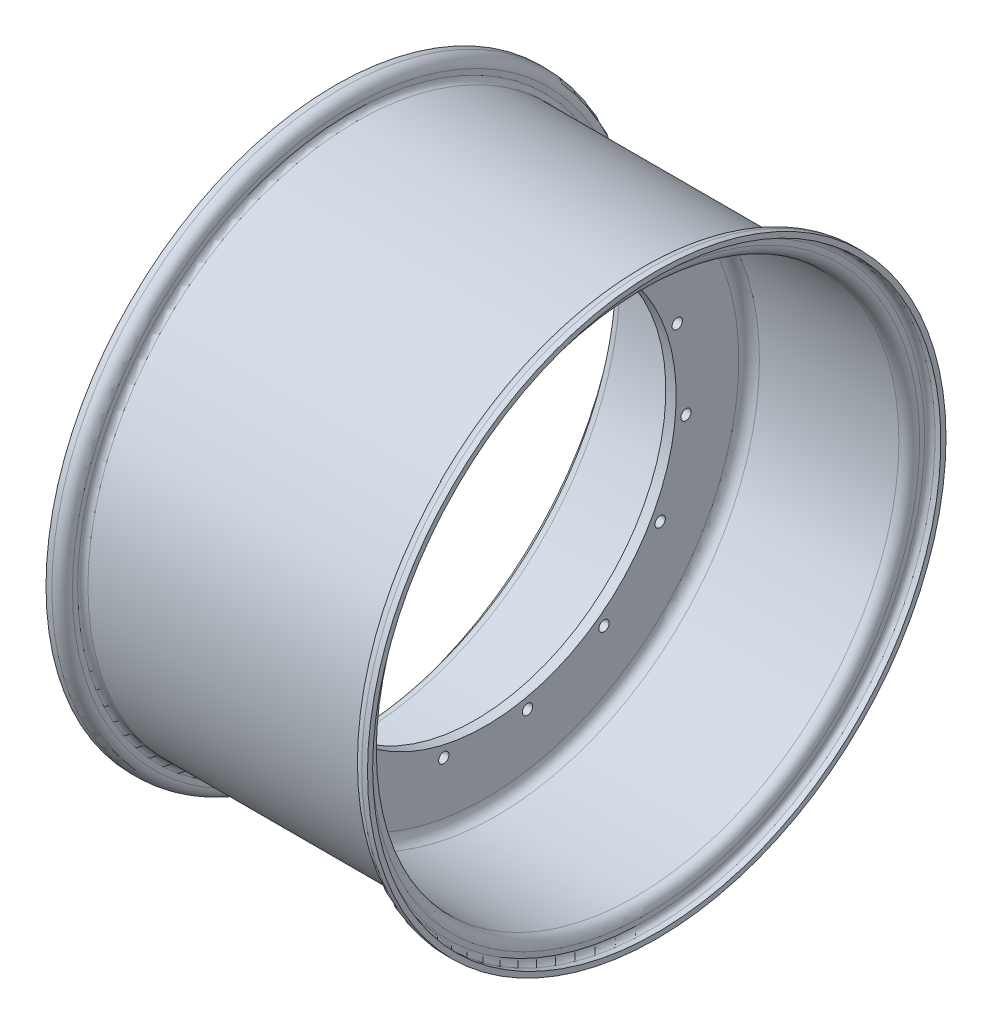
ISO-10303-21;
HEADER;
FILE_DESCRIPTION(('STEP AP214'),'2;1');
FILE_NAME('part.step','',(''),(''),'','','');
FILE_SCHEMA(('AUTOMOTIVE_DESIGN { 1 0 10303 214 1 1 1 1 }'));
ENDSEC;
DATA;
#1=APPLICATION_CONTEXT('core data for automotive mechanical design processes');
#2=APPLICATION_PROTOCOL_DEFINITION('international standard','automotive_design',2000,#1);
#3=PRODUCT_CONTEXT('',#1,'mechanical');
#4=PRODUCT('Part','Part','',(#3));
#5=PRODUCT_RELATED_PRODUCT_CATEGORY('part','',(#4));
#6=PRODUCT_DEFINITION_FORMATION('','',#4);
#7=PRODUCT_DEFINITION_CONTEXT('part definition',#1,'design');
#8=PRODUCT_DEFINITION('design','',#6,#7);
#9=PRODUCT_DEFINITION_SHAPE('','',#8);
#10=(LENGTH_UNIT() NAMED_UNIT(*) SI_UNIT(.MILLI.,.METRE.));
#11=(NAMED_UNIT(*) PLANE_ANGLE_UNIT() SI_UNIT($,.RADIAN.));
#12=(NAMED_UNIT(*) SI_UNIT($,.STERADIAN.) SOLID_ANGLE_UNIT());
#13=UNCERTAINTY_MEASURE_WITH_UNIT(LENGTH_MEASURE(1.E-05),#10,'distance_accuracy_value','');
#14=(GEOMETRIC_REPRESENTATION_CONTEXT(3) GLOBAL_UNCERTAINTY_ASSIGNED_CONTEXT((#13)) GLOBAL_UNIT_ASSIGNED_CONTEXT((#10,
#11,#12)) REPRESENTATION_CONTEXT('',''));
#15=CARTESIAN_POINT('',(0.,0.,0.));
#16=DIRECTION('',(0.,0.,1.));
#17=DIRECTION('',(1.,0.,0.));
#18=AXIS2_PLACEMENT_3D('',#15,#16,#17);
#19=CARTESIAN_POINT('',(104.775,0.,0.));
#20=DIRECTION('',(-1.,0.,0.));
#21=DIRECTION('',(0.,0.,1.));
#22=AXIS2_PLACEMENT_3D('',#19,#20,#21);
#23=TOROIDAL_SURFACE('',#22,171.45,3.17499999999999);
#24=CARTESIAN_POINT('',(104.775,0.,0.));
#25=DIRECTION('',(-1.,0.,0.));
#26=DIRECTION('',(0.,0.,1.));
#27=AXIS2_PLACEMENT_3D('',#24,#25,#26);
#28=CIRCLE('',#27,174.625);
#29=CARTESIAN_POINT('',(104.775,0.,174.625));
#30=VERTEX_POINT('',#29);
#31=EDGE_CURVE('E116',#30,#30,#28,.T.);
#32=ORIENTED_EDGE('',*,*,#31,.F.);
#33=EDGE_LOOP('',(#32));
#34=FACE_BOUND('',#33,.T.);
#35=CARTESIAN_POINT('',(101.6,0.,0.));
#36=DIRECTION('',(-1.,0.,0.));
#37=DIRECTION('',(0.,0.,1.));
#38=AXIS2_PLACEMENT_3D('',#35,#36,#37);
#39=CIRCLE('',#38,171.45);
#40=CARTESIAN_POINT('',(101.6,0.,171.45));
#41=VERTEX_POINT('',#40);
#42=EDGE_CURVE('E53',#41,#41,#39,.T.);
#43=ORIENTED_EDGE('',*,*,#42,.T.);
#44=EDGE_LOOP('',(#43));
#45=FACE_BOUND('',#44,.T.);
#46=ADVANCED_FACE('F33',(#34,#45),#23,.F.);
#47=CARTESIAN_POINT('',(101.6,168.275,0.));
#48=DIRECTION('',(-1.,0.,0.));
#49=DIRECTION('',(0.,0.,1.));
#50=AXIS2_PLACEMENT_3D('',#47,#48,#49);
#51=PLANE('',#50);
#52=ORIENTED_EDGE('',*,*,#42,.F.);
#53=EDGE_LOOP('',(#52));
#54=FACE_BOUND('',#53,.T.);
#55=CARTESIAN_POINT('',(101.6,0.,0.));
#56=DIRECTION('',(-1.,0.,0.));
#57=DIRECTION('',(0.,0.,1.));
#58=AXIS2_PLACEMENT_3D('',#55,#56,#57);
#59=CIRCLE('',#58,168.275);
#60=CARTESIAN_POINT('',(101.6,0.,168.275));
#61=VERTEX_POINT('',#60);
#62=EDGE_CURVE('E56',#61,#61,#59,.T.);
#63=ORIENTED_EDGE('',*,*,#62,.T.);
#64=EDGE_LOOP('',(#63));
#65=FACE_BOUND('',#64,.T.);
#66=ADVANCED_FACE('F261',(#54,#65),#51,.F.);
#67=CARTESIAN_POINT('',(95.25,0.,0.));
#68=DIRECTION('',(-1.,0.,0.));
#69=DIRECTION('',(0.,0.,1.));
#70=AXIS2_PLACEMENT_3D('',#67,#68,#69);
#71=TOROIDAL_SURFACE('',#70,168.275,6.35);
#72=ORIENTED_EDGE('',*,*,#62,.F.);
#73=EDGE_LOOP('',(#72));
#74=FACE_BOUND('',#73,.T.);
#75=CARTESIAN_POINT('',(95.25,0.,0.));
#76=DIRECTION('',(-1.,0.,0.));
#77=DIRECTION('',(0.,0.,1.));
#78=AXIS2_PLACEMENT_3D('',#75,#76,#77);
#79=CIRCLE('',#78,161.925);
#80=CARTESIAN_POINT('',(95.25,0.,161.925));
#81=VERTEX_POINT('',#80);
#82=EDGE_CURVE('E59',#81,#81,#79,.T.);
#83=ORIENTED_EDGE('',*,*,#82,.T.);
#84=EDGE_LOOP('',(#83));
#85=FACE_BOUND('',#84,.T.);
#86=ADVANCED_FACE('F267',(#74,#85),#71,.T.);
#87=CARTESIAN_POINT('',(-87.0379104783021,0.,0.));
#88=DIRECTION('',(-1.,0.,0.));
#89=DIRECTION('',(0.,0.,1.));
#90=AXIS2_PLACEMENT_3D('',#87,#88,#89);
#91=CYLINDRICAL_SURFACE('',#90,161.925);
#92=CARTESIAN_POINT('',(9.52500000000001,0.,0.));
#93=DIRECTION('',(-1.,0.,0.));
#94=DIRECTION('',(0.,0.,1.));
#95=AXIS2_PLACEMENT_3D('',#92,#93,#94);
#96=CIRCLE('',#95,161.925);
#97=CARTESIAN_POINT('',(9.52500000000001,0.,161.925));
#98=VERTEX_POINT('',#97);
#99=EDGE_CURVE('E40',#98,#98,#96,.T.);
#100=ORIENTED_EDGE('',*,*,#99,.T.);
#101=EDGE_LOOP('',(#100));
#102=FACE_BOUND('',#101,.T.);
#103=ORIENTED_EDGE('',*,*,#82,.F.);
#104=EDGE_LOOP('',(#103));
#105=FACE_BOUND('',#104,.T.);
#106=ADVANCED_FACE('F257',(#102,#105),#91,.F.);
#107=CARTESIAN_POINT('',(3.17500000000001,117.094,0.));
#108=DIRECTION('',(-1.,0.,0.));
#109=DIRECTION('',(0.,0.,1.));
#110=AXIS2_PLACEMENT_3D('',#107,#108,#109);
#111=PLANE('',#110);
#112=CARTESIAN_POINT('',(3.17500000000001,0.,0.));
#113=DIRECTION('',(-1.,0.,0.));
#114=DIRECTION('',(0.,0.,1.));
#115=AXIS2_PLACEMENT_3D('',#112,#113,#114);
#116=CIRCLE('',#115,155.575);
#117=CARTESIAN_POINT('',(3.17500000000001,0.,155.575));
#118=VERTEX_POINT('',#117);
#119=EDGE_CURVE('E10',#118,#118,#116,.F.);
#120=ORIENTED_EDGE('',*,*,#119,.T.);
#121=EDGE_LOOP('',(#120));
#122=FACE_BOUND('',#121,.T.);
#123=CARTESIAN_POINT('',(3.17500000000001,113.119766292596,50.3641648288596));
#124=DIRECTION('',(-1.,0.,0.));
#125=DIRECTION('',(0.,0.,1.));
#126=AXIS2_PLACEMENT_3D('',#123,#124,#125);
#127=CIRCLE('',#126,3.175);
#128=CARTESIAN_POINT('',(3.17500000000001,113.119766292596,53.5391648288595));
#129=VERTEX_POINT('',#128);
#130=EDGE_CURVE('E203',#129,#129,#127,.T.);
#131=ORIENTED_EDGE('',*,*,#130,.T.);
#132=EDGE_LOOP('',(#131));
#133=FACE_BOUND('',#132,.T.);
#134=CARTESIAN_POINT('',(3.17500000000001,82.8550973323867,92.0199080147374));
#135=DIRECTION('',(-1.,0.,0.));
#136=DIRECTION('',(0.,0.,1.));
#137=AXIS2_PLACEMENT_3D('',#134,#135,#136);
#138=CIRCLE('',#137,3.175);
#139=CARTESIAN_POINT('',(3.17500000000001,82.8550973323867,95.1949080147374));
#140=VERTEX_POINT('',#139);
#141=EDGE_CURVE('E197',#140,#140,#138,.T.);
#142=ORIENTED_EDGE('',*,*,#141,.T.);
#143=EDGE_LOOP('',(#142));
#144=FACE_BOUND('',#143,.T.);
#145=CARTESIAN_POINT('',(3.17500000000001,38.2640293284791,117.764573130247));
#146=DIRECTION('',(-1.,0.,0.));
#147=DIRECTION('',(0.,0.,1.));
#148=AXIS2_PLACEMENT_3D('',#145,#146,#147);
#149=CIRCLE('',#148,3.175);
#150=CARTESIAN_POINT('',(3.17500000000001,38.2640293284791,120.939573130247));
#151=VERTEX_POINT('',#150);
#152=EDGE_CURVE('E191',#151,#151,#149,.T.);
#153=ORIENTED_EDGE('',*,*,#152,.T.);
#154=EDGE_LOOP('',(#153));
#155=FACE_BOUND('',#154,.T.);
#156=CARTESIAN_POINT('',(3.17500000000001,-12.943236964116,123.146673693977));
#157=DIRECTION('',(-1.,0.,0.));
#158=DIRECTION('',(0.,0.,1.));
#159=AXIS2_PLACEMENT_3D('',#156,#157,#158);
#160=CIRCLE('',#159,3.175);
#161=CARTESIAN_POINT('',(3.17500000000001,-12.943236964116,126.321673693977));
#162=VERTEX_POINT('',#161);
#163=EDGE_CURVE('E185',#162,#162,#160,.T.);
#164=ORIENTED_EDGE('',*,*,#163,.T.);
#165=EDGE_LOOP('',(#164));
#166=FACE_BOUND('',#165,.T.);
#167=CARTESIAN_POINT('',(3.17500000000001,-61.912499999999,107.235595623609));
#168=DIRECTION('',(-1.,0.,0.));
#169=DIRECTION('',(0.,0.,1.));
#170=AXIS2_PLACEMENT_3D('',#167,#168,#169);
#171=CIRCLE('',#170,3.175);
#172=CARTESIAN_POINT('',(3.17500000000001,-61.912499999999,110.410595623609));
#173=VERTEX_POINT('',#172);
#174=EDGE_CURVE('E179',#173,#173,#171,.T.);
#175=ORIENTED_EDGE('',*,*,#174,.T.);
#176=EDGE_LOOP('',(#175));
#177=FACE_BOUND('',#176,.T.);
#178=CARTESIAN_POINT('',(3.17500000000001,-100.176529328477,72.7825088651163));
#179=DIRECTION('',(-1.,0.,0.));
#180=DIRECTION('',(0.,0.,1.));
#181=AXIS2_PLACEMENT_3D('',#178,#179,#180);
#182=CIRCLE('',#181,3.175);
#183=CARTESIAN_POINT('',(3.17500000000001,-100.176529328477,75.9575088651163));
#184=VERTEX_POINT('',#183);
#185=EDGE_CURVE('E173',#184,#184,#182,.T.);
#186=ORIENTED_EDGE('',*,*,#185,.T.);
#187=EDGE_LOOP('',(#186));
#188=FACE_BOUND('',#187,.T.);
#189=CARTESIAN_POINT('',(3.17500000000001,-121.119126660863,25.7446651155099));
#190=DIRECTION('',(-1.,0.,0.));
#191=DIRECTION('',(0.,0.,1.));
#192=AXIS2_PLACEMENT_3D('',#189,#190,#191);
#193=CIRCLE('',#192,3.175);
#194=CARTESIAN_POINT('',(3.17500000000001,-121.119126660863,28.9196651155099));
#195=VERTEX_POINT('',#194);
#196=EDGE_CURVE('E167',#195,#195,#193,.T.);
#197=ORIENTED_EDGE('',*,*,#196,.T.);
#198=EDGE_LOOP('',(#197));
#199=FACE_BOUND('',#198,.T.);
#200=CARTESIAN_POINT('',(3.17500000000001,-121.119126660864,-25.7446651155083));
#201=DIRECTION('',(-1.,0.,0.));
#202=DIRECTION('',(0.,0.,1.));
#203=AXIS2_PLACEMENT_3D('',#200,#201,#202);
#204=CIRCLE('',#203,3.175);
#205=CARTESIAN_POINT('',(3.17500000000001,-121.119126660864,-22.5696651155083));
#206=VERTEX_POINT('',#205);
#207=EDGE_CURVE('E161',#206,#206,#204,.T.);
#208=ORIENTED_EDGE('',*,*,#207,.T.);
#209=EDGE_LOOP('',(#208));
#210=FACE_BOUND('',#209,.T.);
#211=CARTESIAN_POINT('',(3.17500000000001,-100.176529328478,-72.782508865115));
#212=DIRECTION('',(-1.,0.,0.));
#213=DIRECTION('',(0.,0.,1.));
#214=AXIS2_PLACEMENT_3D('',#211,#212,#213);
#215=CIRCLE('',#214,3.175);
#216=CARTESIAN_POINT('',(3.17500000000001,-100.176529328478,-69.607508865115));
#217=VERTEX_POINT('',#216);
#218=EDGE_CURVE('E155',#217,#217,#215,.T.);
#219=ORIENTED_EDGE('',*,*,#218,.T.);
#220=EDGE_LOOP('',(#219));
#221=FACE_BOUND('',#220,.T.);
#222=CARTESIAN_POINT('',(3.17500000000001,-61.9125000000005,-107.235595623608));
#223=DIRECTION('',(-1.,0.,0.));
#224=DIRECTION('',(0.,0.,1.));
#225=AXIS2_PLACEMENT_3D('',#222,#223,#224);
#226=CIRCLE('',#225,3.175);
#227=CARTESIAN_POINT('',(3.17500000000001,-61.9125000000005,-104.060595623608));
#228=VERTEX_POINT('',#227);
#229=EDGE_CURVE('E149',#228,#228,#226,.T.);
#230=ORIENTED_EDGE('',*,*,#229,.T.);
#231=EDGE_LOOP('',(#230));
#232=FACE_BOUND('',#231,.T.);
#233=CARTESIAN_POINT('',(3.17500000000001,-12.9432369641176,-123.146673693976));
#234=DIRECTION('',(-1.,0.,0.));
#235=DIRECTION('',(0.,0.,1.));
#236=AXIS2_PLACEMENT_3D('',#233,#234,#235);
#237=CIRCLE('',#236,3.175);
#238=CARTESIAN_POINT('',(3.17500000000001,-12.9432369641176,-119.971673693976));
#239=VERTEX_POINT('',#238);
#240=EDGE_CURVE('E143',#239,#239,#237,.T.);
#241=ORIENTED_EDGE('',*,*,#240,.T.);
#242=EDGE_LOOP('',(#241));
#243=FACE_BOUND('',#242,.T.);
#244=CARTESIAN_POINT('',(3.17500000000001,38.2640293284776,-117.764573130247));
#245=DIRECTION('',(-1.,0.,0.));
#246=DIRECTION('',(0.,0.,1.));
#247=AXIS2_PLACEMENT_3D('',#244,#245,#246);
#248=CIRCLE('',#247,3.175);
#249=CARTESIAN_POINT('',(3.17500000000001,38.2640293284776,-114.589573130247));
#250=VERTEX_POINT('',#249);
#251=EDGE_CURVE('E137',#250,#250,#248,.T.);
#252=ORIENTED_EDGE('',*,*,#251,.T.);
#253=EDGE_LOOP('',(#252));
#254=FACE_BOUND('',#253,.T.);
#255=CARTESIAN_POINT('',(3.17500000000001,82.8550973323855,-92.0199080147385));
#256=DIRECTION('',(-1.,0.,0.));
#257=DIRECTION('',(0.,0.,1.));
#258=AXIS2_PLACEMENT_3D('',#255,#256,#257);
#259=CIRCLE('',#258,3.175);
#260=CARTESIAN_POINT('',(3.17500000000001,82.8550973323855,-88.8449080147385));
#261=VERTEX_POINT('',#260);
#262=EDGE_CURVE('E131',#261,#261,#259,.T.);
#263=ORIENTED_EDGE('',*,*,#262,.T.);
#264=EDGE_LOOP('',(#263));
#265=FACE_BOUND('',#264,.T.);
#266=CARTESIAN_POINT('',(3.17500000000001,113.119766292595,-50.3641648288611));
#267=DIRECTION('',(-1.,0.,0.));
#268=DIRECTION('',(0.,0.,1.));
#269=AXIS2_PLACEMENT_3D('',#266,#267,#268);
#270=CIRCLE('',#269,3.175);
#271=CARTESIAN_POINT('',(3.17500000000001,113.119766292595,-47.1891648288611));
#272=VERTEX_POINT('',#271);
#273=EDGE_CURVE('E125',#272,#272,#270,.T.);
#274=ORIENTED_EDGE('',*,*,#273,.T.);
#275=EDGE_LOOP('',(#274));
#276=FACE_BOUND('',#275,.T.);
#277=CARTESIAN_POINT('',(3.17500000000001,123.825,0.));
#278=DIRECTION('',(-1.,0.,0.));
#279=DIRECTION('',(0.,0.,1.));
#280=AXIS2_PLACEMENT_3D('',#277,#278,#279);
#281=CIRCLE('',#280,3.175);
#282=CARTESIAN_POINT('',(3.17500000000001,123.825,3.175));
#283=VERTEX_POINT('',#282);
#284=EDGE_CURVE('E119',#283,#283,#281,.T.);
#285=ORIENTED_EDGE('',*,*,#284,.T.);
#286=EDGE_LOOP('',(#285));
#287=FACE_BOUND('',#286,.T.);
#288=CARTESIAN_POINT('',(3.17500000000001,0.,0.));
#289=DIRECTION('',(-1.,0.,0.));
#290=DIRECTION('',(0.,0.,1.));
#291=AXIS2_PLACEMENT_3D('',#288,#289,#290);
#292=CIRCLE('',#291,117.094);
#293=CARTESIAN_POINT('',(3.17500000000001,0.,117.094));
#294=VERTEX_POINT('',#293);
#295=EDGE_CURVE('E62',#294,#294,#292,.T.);
#296=ORIENTED_EDGE('',*,*,#295,.T.);
#297=EDGE_LOOP('',(#296));
#298=FACE_BOUND('',#297,.T.);
#299=ADVANCED_FACE('F251',(#122,#133,#144,#155,#166,#177,#188,#199,#210,#221,#232,#243,#254,
#265,#276,#287,#298),#111,.F.);
#300=CARTESIAN_POINT('',(-87.0379104783021,0.,0.));
#301=DIRECTION('',(-1.,0.,0.));
#302=DIRECTION('',(0.,0.,1.));
#303=AXIS2_PLACEMENT_3D('',#300,#301,#302);
#304=CYLINDRICAL_SURFACE('',#303,117.094);
#305=ORIENTED_EDGE('',*,*,#295,.F.);
#306=EDGE_LOOP('',(#305));
#307=FACE_BOUND('',#306,.T.);
#308=CARTESIAN_POINT('',(-3.175,0.,0.));
#309=DIRECTION('',(-1.,0.,0.));
#310=DIRECTION('',(0.,0.,1.));
#311=AXIS2_PLACEMENT_3D('',#308,#309,#310);
#312=CIRCLE('',#311,117.094);
#313=CARTESIAN_POINT('',(-3.175,0.,117.094));
#314=VERTEX_POINT('',#313);
#315=EDGE_CURVE('E65',#314,#314,#312,.T.);
#316=ORIENTED_EDGE('',*,*,#315,.T.);
#317=EDGE_LOOP('',(#316));
#318=FACE_BOUND('',#317,.T.);
#319=ADVANCED_FACE('F217',(#307,#318),#304,.F.);
#320=CARTESIAN_POINT('',(-3.175,161.925,0.));
#321=DIRECTION('',(1.,0.,0.));
#322=DIRECTION('',(0.,0.,-1.));
#323=AXIS2_PLACEMENT_3D('',#320,#321,#322);
#324=PLANE('',#323);
#325=CARTESIAN_POINT('',(-3.175,0.,0.));
#326=DIRECTION('',(1.,0.,0.));
#327=DIRECTION('',(0.,0.,-1.));
#328=AXIS2_PLACEMENT_3D('',#325,#326,#327);
#329=CIRCLE('',#328,155.575);
#330=CARTESIAN_POINT('',(-3.175,0.,-155.575));
#331=VERTEX_POINT('',#330);
#332=EDGE_CURVE('E48',#331,#331,#329,.F.);
#333=ORIENTED_EDGE('',*,*,#332,.T.);
#334=EDGE_LOOP('',(#333));
#335=FACE_BOUND('',#334,.T.);
#336=CARTESIAN_POINT('',(-3.175,113.119766292596,50.3641648288596));
#337=DIRECTION('',(-1.,0.,0.));
#338=DIRECTION('',(0.,-0.406736643075789,0.913545457642606));
#339=AXIS2_PLACEMENT_3D('',#336,#337,#338);
#340=CIRCLE('',#339,3.175);
#341=CARTESIAN_POINT('',(-3.175,111.82837745083,53.2646716568748));
#342=VERTEX_POINT('',#341);
#343=EDGE_CURVE('E206',#342,#342,#340,.T.);
#344=ORIENTED_EDGE('',*,*,#343,.F.);
#345=EDGE_LOOP('',(#344));
#346=FACE_BOUND('',#345,.T.);
#347=CARTESIAN_POINT('',(-3.175,82.8550973323867,92.0199080147374));
#348=DIRECTION('',(-1.,0.,0.));
#349=DIRECTION('',(0.,-0.743144825477386,0.669130606358867));
#350=AXIS2_PLACEMENT_3D('',#347,#348,#349);
#351=CIRCLE('',#350,3.175);
#352=CARTESIAN_POINT('',(-3.175,80.495612511496,94.1443976899267));
#353=VERTEX_POINT('',#352);
#354=EDGE_CURVE('E200',#353,#353,#351,.T.);
#355=ORIENTED_EDGE('',*,*,#354,.F.);
#356=EDGE_LOOP('',(#355));
#357=FACE_BOUND('',#356,.T.);
#358=CARTESIAN_POINT('',(-3.175,38.2640293284791,117.764573130247));
#359=DIRECTION('',(-1.,0.,0.));
#360=DIRECTION('',(0.,-0.95105651629515,0.309016994374957));
#361=AXIS2_PLACEMENT_3D('',#358,#359,#360);
#362=CIRCLE('',#361,3.175);
#363=CARTESIAN_POINT('',(-3.175,35.244424889242,118.745702087387));
#364=VERTEX_POINT('',#363);
#365=EDGE_CURVE('E194',#364,#364,#362,.T.);
#366=ORIENTED_EDGE('',*,*,#365,.F.);
#367=EDGE_LOOP('',(#366));
#368=FACE_BOUND('',#367,.T.);
#369=CARTESIAN_POINT('',(-3.175,-12.943236964116,123.146673693977));
#370=DIRECTION('',(-1.,0.,0.));
#371=DIRECTION('',(0.,-0.994521895368274,-0.104528463267644));
#372=AXIS2_PLACEMENT_3D('',#369,#370,#371);
#373=CIRCLE('',#372,3.175);
#374=CARTESIAN_POINT('',(-3.175,-16.1008439819102,122.814795823102));
#375=VERTEX_POINT('',#374);
#376=EDGE_CURVE('E188',#375,#375,#373,.T.);
#377=ORIENTED_EDGE('',*,*,#376,.F.);
#378=EDGE_LOOP('',(#377));
#379=FACE_BOUND('',#378,.T.);
#380=CARTESIAN_POINT('',(-3.175,-61.912499999999,107.235595623609));
#381=DIRECTION('',(-1.,0.,0.));
#382=DIRECTION('',(0.,-0.866025403784443,-0.499999999999992));
#383=AXIS2_PLACEMENT_3D('',#380,#381,#382);
#384=CIRCLE('',#383,3.175);
#385=CARTESIAN_POINT('',(-3.175,-64.6621306570146,105.648095623609));
#386=VERTEX_POINT('',#385);
#387=EDGE_CURVE('E182',#386,#386,#384,.T.);
#388=ORIENTED_EDGE('',*,*,#387,.F.);
#389=EDGE_LOOP('',(#388));
#390=FACE_BOUND('',#389,.T.);
#391=CARTESIAN_POINT('',(-3.175,-100.176529328477,72.7825088651163));
#392=DIRECTION('',(-1.,0.,0.));
#393=DIRECTION('',(0.,-0.58778525229248,-0.809016994374943));
#394=AXIS2_PLACEMENT_3D('',#391,#392,#393);
#395=CIRCLE('',#394,3.175);
#396=CARTESIAN_POINT('',(-3.175,-102.042747504506,70.2138799079759));
#397=VERTEX_POINT('',#396);
#398=EDGE_CURVE('E176',#397,#397,#395,.T.);
#399=ORIENTED_EDGE('',*,*,#398,.F.);
#400=EDGE_LOOP('',(#399));
#401=FACE_BOUND('',#400,.T.);
#402=CARTESIAN_POINT('',(-3.175,-121.119126660863,25.7446651155099));
#403=DIRECTION('',(-1.,0.,0.));
#404=DIRECTION('',(0.,-0.207911690817766,-0.978147600733804));
#405=AXIS2_PLACEMENT_3D('',#402,#403,#404);
#406=CIRCLE('',#405,3.175);
#407=CARTESIAN_POINT('',(-3.175,-121.77924627921,22.6390464831801));
#408=VERTEX_POINT('',#407);
#409=EDGE_CURVE('E170',#408,#408,#406,.T.);
#410=ORIENTED_EDGE('',*,*,#409,.F.);
#411=EDGE_LOOP('',(#410));
#412=FACE_BOUND('',#411,.T.);
#413=CARTESIAN_POINT('',(-3.175,-121.119126660864,-25.7446651155083));
#414=DIRECTION('',(-1.,0.,0.));
#415=DIRECTION('',(0.,0.207911690817753,-0.978147600733807));
#416=AXIS2_PLACEMENT_3D('',#413,#414,#415);
#417=CIRCLE('',#416,3.175);
#418=CARTESIAN_POINT('',(-3.175,-120.459007042517,-28.8502837478381));
#419=VERTEX_POINT('',#418);
#420=EDGE_CURVE('E164',#419,#419,#417,.T.);
#421=ORIENTED_EDGE('',*,*,#420,.F.);
#422=EDGE_LOOP('',(#421));
#423=FACE_BOUND('',#422,.T.);
#424=CARTESIAN_POINT('',(-3.175,-100.176529328478,-72.782508865115));
#425=DIRECTION('',(-1.,0.,0.));
#426=DIRECTION('',(0.,0.587785252292469,-0.80901699437495));
#427=AXIS2_PLACEMENT_3D('',#424,#425,#426);
#428=CIRCLE('',#427,3.175);
#429=CARTESIAN_POINT('',(-3.175,-98.3103111524496,-75.3511378222554));
#430=VERTEX_POINT('',#429);
#431=EDGE_CURVE('E158',#430,#430,#428,.T.);
#432=ORIENTED_EDGE('',*,*,#431,.F.);
#433=EDGE_LOOP('',(#432));
#434=FACE_BOUND('',#433,.T.);
#435=CARTESIAN_POINT('',(-3.175,-61.9125000000005,-107.235595623608));
#436=DIRECTION('',(-1.,0.,0.));
#437=DIRECTION('',(0.,0.866025403784436,-0.500000000000004));
#438=AXIS2_PLACEMENT_3D('',#435,#436,#437);
#439=CIRCLE('',#438,3.175);
#440=CARTESIAN_POINT('',(-3.175,-59.1628693429849,-108.823095623608));
#441=VERTEX_POINT('',#440);
#442=EDGE_CURVE('E152',#441,#441,#439,.T.);
#443=ORIENTED_EDGE('',*,*,#442,.F.);
#444=EDGE_LOOP('',(#443));
#445=FACE_BOUND('',#444,.T.);
#446=CARTESIAN_POINT('',(-3.175,-12.9432369641176,-123.146673693976));
#447=DIRECTION('',(-1.,0.,0.));
#448=DIRECTION('',(0.,0.994521895368273,-0.104528463267657));
#449=AXIS2_PLACEMENT_3D('',#446,#447,#448);
#450=CIRCLE('',#449,3.175);
#451=CARTESIAN_POINT('',(-3.175,-9.78562994632337,-123.478551564851));
#452=VERTEX_POINT('',#451);
#453=EDGE_CURVE('E146',#452,#452,#450,.T.);
#454=ORIENTED_EDGE('',*,*,#453,.F.);
#455=EDGE_LOOP('',(#454));
#456=FACE_BOUND('',#455,.T.);
#457=CARTESIAN_POINT('',(-3.175,38.2640293284776,-117.764573130247));
#458=DIRECTION('',(-1.,0.,0.));
#459=DIRECTION('',(0.,0.951056516295154,0.309016994374945));
#460=AXIS2_PLACEMENT_3D('',#457,#458,#459);
#461=CIRCLE('',#460,3.175);
#462=CARTESIAN_POINT('',(-3.175,41.2836337677147,-116.783444173107));
#463=VERTEX_POINT('',#462);
#464=EDGE_CURVE('E140',#463,#463,#461,.T.);
#465=ORIENTED_EDGE('',*,*,#464,.F.);
#466=EDGE_LOOP('',(#465));
#467=FACE_BOUND('',#466,.T.);
#468=CARTESIAN_POINT('',(-3.175,82.8550973323855,-92.0199080147385));
#469=DIRECTION('',(-1.,0.,0.));
#470=DIRECTION('',(0.,0.743144825477395,0.669130606358857));
#471=AXIS2_PLACEMENT_3D('',#468,#469,#470);
#472=CIRCLE('',#471,3.175);
#473=CARTESIAN_POINT('',(-3.175,85.2145821532762,-89.8954183395491));
#474=VERTEX_POINT('',#473);
#475=EDGE_CURVE('E134',#474,#474,#472,.T.);
#476=ORIENTED_EDGE('',*,*,#475,.F.);
#477=EDGE_LOOP('',(#476));
#478=FACE_BOUND('',#477,.T.);
#479=CARTESIAN_POINT('',(-3.175,113.119766292595,-50.3641648288611));
#480=DIRECTION('',(-1.,0.,0.));
#481=DIRECTION('',(0.,0.406736643075801,0.913545457642601));
#482=AXIS2_PLACEMENT_3D('',#479,#480,#481);
#483=CIRCLE('',#482,3.175);
#484=CARTESIAN_POINT('',(-3.175,114.411155134361,-47.4636580008458));
#485=VERTEX_POINT('',#484);
#486=EDGE_CURVE('E128',#485,#485,#483,.T.);
#487=ORIENTED_EDGE('',*,*,#486,.F.);
#488=EDGE_LOOP('',(#487));
#489=FACE_BOUND('',#488,.T.);
#490=CARTESIAN_POINT('',(-3.175,123.825,0.));
#491=DIRECTION('',(-1.,0.,0.));
#492=DIRECTION('',(0.,0.,1.));
#493=AXIS2_PLACEMENT_3D('',#490,#491,#492);
#494=CIRCLE('',#493,3.175);
#495=CARTESIAN_POINT('',(-3.175,123.825,3.175));
#496=VERTEX_POINT('',#495);
#497=EDGE_CURVE('E122',#496,#496,#494,.T.);
#498=ORIENTED_EDGE('',*,*,#497,.F.);
#499=EDGE_LOOP('',(#498));
#500=FACE_BOUND('',#499,.T.);
#501=ORIENTED_EDGE('',*,*,#315,.F.);
#502=EDGE_LOOP('',(#501));
#503=FACE_BOUND('',#502,.T.);
#504=ADVANCED_FACE('F213',(#335,#346,#357,#368,#379,#390,#401,#412,#423,#434,#445,#456,#467,
#478,#489,#500,#503),#324,.F.);
#505=CARTESIAN_POINT('',(-87.0379104783021,0.,0.));
#506=DIRECTION('',(-1.,0.,0.));
#507=DIRECTION('',(0.,0.,1.));
#508=AXIS2_PLACEMENT_3D('',#505,#506,#507);
#509=CYLINDRICAL_SURFACE('',#508,161.925);
#510=CARTESIAN_POINT('',(-9.52500000000001,0.,0.));
#511=DIRECTION('',(1.,0.,0.));
#512=DIRECTION('',(0.,0.,-1.));
#513=AXIS2_PLACEMENT_3D('',#510,#511,#512);
#514=CIRCLE('',#513,161.925);
#515=CARTESIAN_POINT('',(-9.52500000000001,0.,-161.925));
#516=VERTEX_POINT('',#515);
#517=EDGE_CURVE('E44',#516,#516,#514,.T.);
#518=ORIENTED_EDGE('',*,*,#517,.T.);
#519=EDGE_LOOP('',(#518));
#520=FACE_BOUND('',#519,.T.);
#521=CARTESIAN_POINT('',(-76.2,0.,0.));
#522=DIRECTION('',(-1.,0.,0.));
#523=DIRECTION('',(0.,0.,1.));
#524=AXIS2_PLACEMENT_3D('',#521,#522,#523);
#525=CIRCLE('',#524,161.925);
#526=CARTESIAN_POINT('',(-76.2,0.,161.925));
#527=VERTEX_POINT('',#526);
#528=EDGE_CURVE('E68',#527,#527,#525,.T.);
#529=ORIENTED_EDGE('',*,*,#528,.T.);
#530=EDGE_LOOP('',(#529));
#531=FACE_BOUND('',#530,.T.);
#532=ADVANCED_FACE('F216',(#520,#531),#509,.F.);
#533=CARTESIAN_POINT('',(-76.2,0.,0.));
#534=DIRECTION('',(-1.,0.,0.));
#535=DIRECTION('',(0.,0.,1.));
#536=AXIS2_PLACEMENT_3D('',#533,#534,#535);
#537=TOROIDAL_SURFACE('',#536,168.275,6.35000000000002);
#538=ORIENTED_EDGE('',*,*,#528,.F.);
#539=EDGE_LOOP('',(#538));
#540=FACE_BOUND('',#539,.T.);
#541=CARTESIAN_POINT('',(-82.55,0.,0.));
#542=DIRECTION('',(-1.,0.,0.));
#543=DIRECTION('',(0.,0.,1.));
#544=AXIS2_PLACEMENT_3D('',#541,#542,#543);
#545=CIRCLE('',#544,168.275);
#546=CARTESIAN_POINT('',(-82.55,0.,168.275));
#547=VERTEX_POINT('',#546);
#548=EDGE_CURVE('E71',#547,#547,#545,.T.);
#549=ORIENTED_EDGE('',*,*,#548,.T.);
#550=EDGE_LOOP('',(#549));
#551=FACE_BOUND('',#550,.T.);
#552=ADVANCED_FACE('F289',(#540,#551),#537,.T.);
#553=CARTESIAN_POINT('',(-82.55,168.275,0.));
#554=DIRECTION('',(1.,0.,0.));
#555=DIRECTION('',(0.,0.,-1.));
#556=AXIS2_PLACEMENT_3D('',#553,#554,#555);
#557=PLANE('',#556);
#558=ORIENTED_EDGE('',*,*,#548,.F.);
#559=EDGE_LOOP('',(#558));
#560=FACE_BOUND('',#559,.T.);
#561=CARTESIAN_POINT('',(-82.55,0.,0.));
#562=DIRECTION('',(-1.,0.,0.));
#563=DIRECTION('',(0.,0.,1.));
#564=AXIS2_PLACEMENT_3D('',#561,#562,#563);
#565=CIRCLE('',#564,171.45);
#566=CARTESIAN_POINT('',(-82.55,0.,171.45));
#567=VERTEX_POINT('',#566);
#568=EDGE_CURVE('E74',#567,#567,#565,.T.);
#569=ORIENTED_EDGE('',*,*,#568,.T.);
#570=EDGE_LOOP('',(#569));
#571=FACE_BOUND('',#570,.T.);
#572=ADVANCED_FACE('F295',(#560,#571),#557,.F.);
#573=CARTESIAN_POINT('',(-85.725,0.,0.));
#574=DIRECTION('',(-1.,0.,0.));
#575=DIRECTION('',(0.,0.,1.));
#576=AXIS2_PLACEMENT_3D('',#573,#574,#575);
#577=TOROIDAL_SURFACE('',#576,171.45,3.17499999999999);
#578=ORIENTED_EDGE('',*,*,#568,.F.);
#579=EDGE_LOOP('',(#578));
#580=FACE_BOUND('',#579,.T.);
#581=CARTESIAN_POINT('',(-85.725,0.,0.));
#582=DIRECTION('',(-1.,0.,0.));
#583=DIRECTION('',(0.,0.,1.));
#584=AXIS2_PLACEMENT_3D('',#581,#582,#583);
#585=CIRCLE('',#584,174.625);
#586=CARTESIAN_POINT('',(-85.725,0.,174.625));
#587=VERTEX_POINT('',#586);
#588=EDGE_CURVE('E77',#587,#587,#585,.T.);
#589=ORIENTED_EDGE('',*,*,#588,.T.);
#590=EDGE_LOOP('',(#589));
#591=FACE_BOUND('',#590,.T.);
#592=ADVANCED_FACE('F301',(#580,#591),#577,.F.);
#593=CARTESIAN_POINT('',(-87.0379104783021,0.,0.));
#594=DIRECTION('',(-1.,0.,0.));
#595=DIRECTION('',(0.,0.,1.));
#596=AXIS2_PLACEMENT_3D('',#593,#594,#595);
#597=CYLINDRICAL_SURFACE('',#596,174.625);
#598=ORIENTED_EDGE('',*,*,#588,.F.);
#599=EDGE_LOOP('',(#598));
#600=FACE_BOUND('',#599,.T.);
#601=CARTESIAN_POINT('',(-89.281,0.,0.));
#602=DIRECTION('',(-1.,0.,0.));
#603=DIRECTION('',(0.,0.,1.));
#604=AXIS2_PLACEMENT_3D('',#601,#602,#603);
#605=CIRCLE('',#604,174.625);
#606=CARTESIAN_POINT('',(-89.281,0.,174.625));
#607=VERTEX_POINT('',#606);
#608=EDGE_CURVE('E80',#607,#607,#605,.T.);
#609=ORIENTED_EDGE('',*,*,#608,.T.);
#610=EDGE_LOOP('',(#609));
#611=FACE_BOUND('',#610,.T.);
#612=ADVANCED_FACE('F307',(#600,#611),#597,.F.);
#613=CARTESIAN_POINT('',(-89.281,177.8,0.));
#614=DIRECTION('',(1.,0.,0.));
#615=DIRECTION('',(0.,0.,-1.));
#616=AXIS2_PLACEMENT_3D('',#613,#614,#615);
#617=PLANE('',#616);
#618=ORIENTED_EDGE('',*,*,#608,.F.);
#619=EDGE_LOOP('',(#618));
#620=FACE_BOUND('',#619,.T.);
#621=CARTESIAN_POINT('',(-89.281,0.,0.));
#622=DIRECTION('',(-1.,0.,0.));
#623=DIRECTION('',(0.,0.,1.));
#624=AXIS2_PLACEMENT_3D('',#621,#622,#623);
#625=CIRCLE('',#624,177.8);
#626=CARTESIAN_POINT('',(-89.281,0.,177.8));
#627=VERTEX_POINT('',#626);
#628=EDGE_CURVE('E83',#627,#627,#625,.T.);
#629=ORIENTED_EDGE('',*,*,#628,.T.);
#630=EDGE_LOOP('',(#629));
#631=FACE_BOUND('',#630,.T.);
#632=ADVANCED_FACE('F313',(#620,#631),#617,.F.);
#633=CARTESIAN_POINT('',(-87.0379104783021,0.,0.));
#634=DIRECTION('',(-1.,0.,0.));
#635=DIRECTION('',(0.,0.,1.));
#636=AXIS2_PLACEMENT_3D('',#633,#634,#635);
#637=CYLINDRICAL_SURFACE('',#636,177.8);
#638=ORIENTED_EDGE('',*,*,#628,.F.);
#639=EDGE_LOOP('',(#638));
#640=FACE_BOUND('',#639,.T.);
#641=CARTESIAN_POINT('',(-85.725,0.,0.));
#642=DIRECTION('',(-1.,0.,0.));
#643=DIRECTION('',(0.,0.,1.));
#644=AXIS2_PLACEMENT_3D('',#641,#642,#643);
#645=CIRCLE('',#644,177.8);
#646=CARTESIAN_POINT('',(-85.725,0.,177.8));
#647=VERTEX_POINT('',#646);
#648=EDGE_CURVE('E86',#647,#647,#645,.T.);
#649=ORIENTED_EDGE('',*,*,#648,.T.);
#650=EDGE_LOOP('',(#649));
#651=FACE_BOUND('',#650,.T.);
#652=ADVANCED_FACE('F319',(#640,#651),#637,.T.);
#653=CARTESIAN_POINT('',(-85.725,0.,0.));
#654=DIRECTION('',(-1.,0.,0.));
#655=DIRECTION('',(0.,0.,1.));
#656=AXIS2_PLACEMENT_3D('',#653,#654,#655);
#657=TOROIDAL_SURFACE('',#656,171.45,6.34999999999999);
#658=ORIENTED_EDGE('',*,*,#648,.F.);
#659=EDGE_LOOP('',(#658));
#660=FACE_BOUND('',#659,.T.);
#661=CARTESIAN_POINT('',(-79.375,0.,0.));
#662=DIRECTION('',(-1.,0.,0.));
#663=DIRECTION('',(0.,0.,1.));
#664=AXIS2_PLACEMENT_3D('',#661,#662,#663);
#665=CIRCLE('',#664,171.45);
#666=CARTESIAN_POINT('',(-79.375,0.,171.45));
#667=VERTEX_POINT('',#666);
#668=EDGE_CURVE('E89',#667,#667,#665,.T.);
#669=ORIENTED_EDGE('',*,*,#668,.T.);
#670=EDGE_LOOP('',(#669));
#671=FACE_BOUND('',#670,.T.);
#672=ADVANCED_FACE('F325',(#660,#671),#657,.T.);
#673=CARTESIAN_POINT('',(-79.375,168.275,0.));
#674=DIRECTION('',(-1.,0.,0.));
#675=DIRECTION('',(0.,0.,1.));
#676=AXIS2_PLACEMENT_3D('',#673,#674,#675);
#677=PLANE('',#676);
#678=ORIENTED_EDGE('',*,*,#668,.F.);
#679=EDGE_LOOP('',(#678));
#680=FACE_BOUND('',#679,.T.);
#681=CARTESIAN_POINT('',(-79.375,0.,0.));
#682=DIRECTION('',(-1.,0.,0.));
#683=DIRECTION('',(0.,0.,1.));
#684=AXIS2_PLACEMENT_3D('',#681,#682,#683);
#685=CIRCLE('',#684,168.275);
#686=CARTESIAN_POINT('',(-79.375,0.,168.275));
#687=VERTEX_POINT('',#686);
#688=EDGE_CURVE('E92',#687,#687,#685,.T.);
#689=ORIENTED_EDGE('',*,*,#688,.T.);
#690=EDGE_LOOP('',(#689));
#691=FACE_BOUND('',#690,.T.);
#692=ADVANCED_FACE('F331',(#680,#691),#677,.F.);
#693=CARTESIAN_POINT('',(-76.2,0.,0.));
#694=DIRECTION('',(-1.,0.,0.));
#695=DIRECTION('',(0.,0.,1.));
#696=AXIS2_PLACEMENT_3D('',#693,#694,#695);
#697=TOROIDAL_SURFACE('',#696,168.275,3.17500000000001);
#698=ORIENTED_EDGE('',*,*,#688,.F.);
#699=EDGE_LOOP('',(#698));
#700=FACE_BOUND('',#699,.T.);
#701=CARTESIAN_POINT('',(-76.2,0.,0.));
#702=DIRECTION('',(-1.,0.,0.));
#703=DIRECTION('',(0.,0.,1.));
#704=AXIS2_PLACEMENT_3D('',#701,#702,#703);
#705=CIRCLE('',#704,165.1);
#706=CARTESIAN_POINT('',(-76.2,0.,165.1));
#707=VERTEX_POINT('',#706);
#708=EDGE_CURVE('E95',#707,#707,#705,.T.);
#709=ORIENTED_EDGE('',*,*,#708,.T.);
#710=EDGE_LOOP('',(#709));
#711=FACE_BOUND('',#710,.T.);
#712=ADVANCED_FACE('F337',(#700,#711),#697,.F.);
#713=CARTESIAN_POINT('',(-87.0379104783021,0.,0.));
#714=DIRECTION('',(-1.,0.,0.));
#715=DIRECTION('',(0.,0.,1.));
#716=AXIS2_PLACEMENT_3D('',#713,#714,#715);
#717=CYLINDRICAL_SURFACE('',#716,165.1);
#718=ORIENTED_EDGE('',*,*,#708,.F.);
#719=EDGE_LOOP('',(#718));
#720=FACE_BOUND('',#719,.T.);
#721=CARTESIAN_POINT('',(95.25,0.,0.));
#722=DIRECTION('',(-1.,0.,0.));
#723=DIRECTION('',(0.,0.,1.));
#724=AXIS2_PLACEMENT_3D('',#721,#722,#723);
#725=CIRCLE('',#724,165.1);
#726=CARTESIAN_POINT('',(95.25,0.,165.1));
#727=VERTEX_POINT('',#726);
#728=EDGE_CURVE('E98',#727,#727,#725,.T.);
#729=ORIENTED_EDGE('',*,*,#728,.T.);
#730=EDGE_LOOP('',(#729));
#731=FACE_BOUND('',#730,.T.);
#732=ADVANCED_FACE('F343',(#720,#731),#717,.T.);
#733=CARTESIAN_POINT('',(95.25,0.,0.));
#734=DIRECTION('',(-1.,0.,0.));
#735=DIRECTION('',(0.,0.,1.));
#736=AXIS2_PLACEMENT_3D('',#733,#734,#735);
#737=TOROIDAL_SURFACE('',#736,168.275,3.17500000000003);
#738=ORIENTED_EDGE('',*,*,#728,.F.);
#739=EDGE_LOOP('',(#738));
#740=FACE_BOUND('',#739,.T.);
#741=CARTESIAN_POINT('',(98.425,0.,0.));
#742=DIRECTION('',(-1.,0.,0.));
#743=DIRECTION('',(0.,0.,1.));
#744=AXIS2_PLACEMENT_3D('',#741,#742,#743);
#745=CIRCLE('',#744,168.275);
#746=CARTESIAN_POINT('',(98.425,0.,168.275));
#747=VERTEX_POINT('',#746);
#748=EDGE_CURVE('E101',#747,#747,#745,.T.);
#749=ORIENTED_EDGE('',*,*,#748,.T.);
#750=EDGE_LOOP('',(#749));
#751=FACE_BOUND('',#750,.T.);
#752=ADVANCED_FACE('F349',(#740,#751),#737,.F.);
#753=CARTESIAN_POINT('',(98.425,168.275,0.));
#754=DIRECTION('',(1.,0.,0.));
#755=DIRECTION('',(0.,0.,-1.));
#756=AXIS2_PLACEMENT_3D('',#753,#754,#755);
#757=PLANE('',#756);
#758=ORIENTED_EDGE('',*,*,#748,.F.);
#759=EDGE_LOOP('',(#758));
#760=FACE_BOUND('',#759,.T.);
#761=CARTESIAN_POINT('',(98.425,0.,0.));
#762=DIRECTION('',(-1.,0.,0.));
#763=DIRECTION('',(0.,0.,1.));
#764=AXIS2_PLACEMENT_3D('',#761,#762,#763);
#765=CIRCLE('',#764,171.45);
#766=CARTESIAN_POINT('',(98.425,0.,171.45));
#767=VERTEX_POINT('',#766);
#768=EDGE_CURVE('E104',#767,#767,#765,.T.);
#769=ORIENTED_EDGE('',*,*,#768,.T.);
#770=EDGE_LOOP('',(#769));
#771=FACE_BOUND('',#770,.T.);
#772=ADVANCED_FACE('F355',(#760,#771),#757,.F.);
#773=CARTESIAN_POINT('',(104.775,0.,0.));
#774=DIRECTION('',(-1.,0.,0.));
#775=DIRECTION('',(0.,0.,1.));
#776=AXIS2_PLACEMENT_3D('',#773,#774,#775);
#777=TOROIDAL_SURFACE('',#776,171.45,6.34999999999999);
#778=ORIENTED_EDGE('',*,*,#768,.F.);
#779=EDGE_LOOP('',(#778));
#780=FACE_BOUND('',#779,.T.);
#781=CARTESIAN_POINT('',(104.775,0.,0.));
#782=DIRECTION('',(-1.,0.,0.));
#783=DIRECTION('',(0.,0.,1.));
#784=AXIS2_PLACEMENT_3D('',#781,#782,#783);
#785=CIRCLE('',#784,177.8);
#786=CARTESIAN_POINT('',(104.775,0.,177.8));
#787=VERTEX_POINT('',#786);
#788=EDGE_CURVE('E107',#787,#787,#785,.T.);
#789=ORIENTED_EDGE('',*,*,#788,.T.);
#790=EDGE_LOOP('',(#789));
#791=FACE_BOUND('',#790,.T.);
#792=ADVANCED_FACE('F361',(#780,#791),#777,.T.);
#793=CARTESIAN_POINT('',(-87.0379104783021,0.,0.));
#794=DIRECTION('',(-1.,0.,0.));
#795=DIRECTION('',(0.,0.,1.));
#796=AXIS2_PLACEMENT_3D('',#793,#794,#795);
#797=CYLINDRICAL_SURFACE('',#796,177.8);
#798=ORIENTED_EDGE('',*,*,#788,.F.);
#799=EDGE_LOOP('',(#798));
#800=FACE_BOUND('',#799,.T.);
#801=CARTESIAN_POINT('',(108.331,0.,0.));
#802=DIRECTION('',(-1.,0.,0.));
#803=DIRECTION('',(0.,0.,1.));
#804=AXIS2_PLACEMENT_3D('',#801,#802,#803);
#805=CIRCLE('',#804,177.8);
#806=CARTESIAN_POINT('',(108.331,0.,177.8));
#807=VERTEX_POINT('',#806);
#808=EDGE_CURVE('E110',#807,#807,#805,.T.);
#809=ORIENTED_EDGE('',*,*,#808,.T.);
#810=EDGE_LOOP('',(#809));
#811=FACE_BOUND('',#810,.T.);
#812=ADVANCED_FACE('F367',(#800,#811),#797,.T.);
#813=CARTESIAN_POINT('',(108.331,174.625,0.));
#814=DIRECTION('',(-1.,0.,0.));
#815=DIRECTION('',(0.,0.,1.));
#816=AXIS2_PLACEMENT_3D('',#813,#814,#815);
#817=PLANE('',#816);
#818=ORIENTED_EDGE('',*,*,#808,.F.);
#819=EDGE_LOOP('',(#818));
#820=FACE_BOUND('',#819,.T.);
#821=CARTESIAN_POINT('',(108.331,0.,0.));
#822=DIRECTION('',(-1.,0.,0.));
#823=DIRECTION('',(0.,0.,1.));
#824=AXIS2_PLACEMENT_3D('',#821,#822,#823);
#825=CIRCLE('',#824,174.625);
#826=CARTESIAN_POINT('',(108.331,0.,174.625));
#827=VERTEX_POINT('',#826);
#828=EDGE_CURVE('E113',#827,#827,#825,.T.);
#829=ORIENTED_EDGE('',*,*,#828,.T.);
#830=EDGE_LOOP('',(#829));
#831=FACE_BOUND('',#830,.T.);
#832=ADVANCED_FACE('F373',(#820,#831),#817,.F.);
#833=CARTESIAN_POINT('',(-87.0379104783021,0.,0.));
#834=DIRECTION('',(-1.,0.,0.));
#835=DIRECTION('',(0.,0.,1.));
#836=AXIS2_PLACEMENT_3D('',#833,#834,#835);
#837=CYLINDRICAL_SURFACE('',#836,174.625);
#838=ORIENTED_EDGE('',*,*,#828,.F.);
#839=EDGE_LOOP('',(#838));
#840=FACE_BOUND('',#839,.T.);
#841=ORIENTED_EDGE('',*,*,#31,.T.);
#842=EDGE_LOOP('',(#841));
#843=FACE_BOUND('',#842,.T.);
#844=ADVANCED_FACE('F379',(#840,#843),#837,.F.);
#845=CARTESIAN_POINT('',(108.331,123.825,0.));
#846=DIRECTION('',(-1.,0.,0.));
#847=DIRECTION('',(0.,0.,1.));
#848=AXIS2_PLACEMENT_3D('',#845,#846,#847);
#849=CYLINDRICAL_SURFACE('',#848,3.175);
#850=ORIENTED_EDGE('',*,*,#497,.T.);
#851=EDGE_LOOP('',(#850));
#852=FACE_BOUND('',#851,.T.);
#853=ORIENTED_EDGE('',*,*,#284,.F.);
#854=EDGE_LOOP('',(#853));
#855=FACE_BOUND('',#854,.T.);
#856=ADVANCED_FACE('F385',(#852,#855),#849,.F.);
#857=CARTESIAN_POINT('',(108.331,113.119766292595,-50.3641648288611));
#858=DIRECTION('',(-1.,0.,0.));
#859=DIRECTION('',(0.,0.,1.));
#860=AXIS2_PLACEMENT_3D('',#857,#858,#859);
#861=CYLINDRICAL_SURFACE('',#860,3.175);
#862=ORIENTED_EDGE('',*,*,#486,.T.);
#863=EDGE_LOOP('',(#862));
#864=FACE_BOUND('',#863,.T.);
#865=ORIENTED_EDGE('',*,*,#273,.F.);
#866=EDGE_LOOP('',(#865));
#867=FACE_BOUND('',#866,.T.);
#868=ADVANCED_FACE('F390',(#864,#867),#861,.F.);
#869=CARTESIAN_POINT('',(108.331,82.8550973323855,-92.0199080147385));
#870=DIRECTION('',(-1.,0.,0.));
#871=DIRECTION('',(0.,0.,1.));
#872=AXIS2_PLACEMENT_3D('',#869,#870,#871);
#873=CYLINDRICAL_SURFACE('',#872,3.175);
#874=ORIENTED_EDGE('',*,*,#475,.T.);
#875=EDGE_LOOP('',(#874));
#876=FACE_BOUND('',#875,.T.);
#877=ORIENTED_EDGE('',*,*,#262,.F.);
#878=EDGE_LOOP('',(#877));
#879=FACE_BOUND('',#878,.T.);
#880=ADVANCED_FACE('F396',(#876,#879),#873,.F.);
#881=CARTESIAN_POINT('',(108.331,38.2640293284776,-117.764573130247));
#882=DIRECTION('',(-1.,0.,0.));
#883=DIRECTION('',(0.,0.,1.));
#884=AXIS2_PLACEMENT_3D('',#881,#882,#883);
#885=CYLINDRICAL_SURFACE('',#884,3.175);
#886=ORIENTED_EDGE('',*,*,#464,.T.);
#887=EDGE_LOOP('',(#886));
#888=FACE_BOUND('',#887,.T.);
#889=ORIENTED_EDGE('',*,*,#251,.F.);
#890=EDGE_LOOP('',(#889));
#891=FACE_BOUND('',#890,.T.);
#892=ADVANCED_FACE('F400',(#888,#891),#885,.F.);
#893=CARTESIAN_POINT('',(108.331,-12.9432369641176,-123.146673693976));
#894=DIRECTION('',(-1.,0.,0.));
#895=DIRECTION('',(0.,0.,1.));
#896=AXIS2_PLACEMENT_3D('',#893,#894,#895);
#897=CYLINDRICAL_SURFACE('',#896,3.175);
#898=ORIENTED_EDGE('',*,*,#453,.T.);
#899=EDGE_LOOP('',(#898));
#900=FACE_BOUND('',#899,.T.);
#901=ORIENTED_EDGE('',*,*,#240,.F.);
#902=EDGE_LOOP('',(#901));
#903=FACE_BOUND('',#902,.T.);
#904=ADVANCED_FACE('F404',(#900,#903),#897,.F.);
#905=CARTESIAN_POINT('',(108.331,-61.9125000000005,-107.235595623608));
#906=DIRECTION('',(-1.,0.,0.));
#907=DIRECTION('',(0.,0.,1.));
#908=AXIS2_PLACEMENT_3D('',#905,#906,#907);
#909=CYLINDRICAL_SURFACE('',#908,3.175);
#910=ORIENTED_EDGE('',*,*,#442,.T.);
#911=EDGE_LOOP('',(#910));
#912=FACE_BOUND('',#911,.T.);
#913=ORIENTED_EDGE('',*,*,#229,.F.);
#914=EDGE_LOOP('',(#913));
#915=FACE_BOUND('',#914,.T.);
#916=ADVANCED_FACE('F408',(#912,#915),#909,.F.);
#917=CARTESIAN_POINT('',(108.331,-100.176529328478,-72.782508865115));
#918=DIRECTION('',(-1.,0.,0.));
#919=DIRECTION('',(0.,0.,1.));
#920=AXIS2_PLACEMENT_3D('',#917,#918,#919);
#921=CYLINDRICAL_SURFACE('',#920,3.175);
#922=ORIENTED_EDGE('',*,*,#431,.T.);
#923=EDGE_LOOP('',(#922));
#924=FACE_BOUND('',#923,.T.);
#925=ORIENTED_EDGE('',*,*,#218,.F.);
#926=EDGE_LOOP('',(#925));
#927=FACE_BOUND('',#926,.T.);
#928=ADVANCED_FACE('F412',(#924,#927),#921,.F.);
#929=CARTESIAN_POINT('',(108.331,-121.119126660864,-25.7446651155083));
#930=DIRECTION('',(-1.,0.,0.));
#931=DIRECTION('',(0.,0.,1.));
#932=AXIS2_PLACEMENT_3D('',#929,#930,#931);
#933=CYLINDRICAL_SURFACE('',#932,3.175);
#934=ORIENTED_EDGE('',*,*,#420,.T.);
#935=EDGE_LOOP('',(#934));
#936=FACE_BOUND('',#935,.T.);
#937=ORIENTED_EDGE('',*,*,#207,.F.);
#938=EDGE_LOOP('',(#937));
#939=FACE_BOUND('',#938,.T.);
#940=ADVANCED_FACE('F416',(#936,#939),#933,.F.);
#941=CARTESIAN_POINT('',(108.331,-121.119126660863,25.7446651155099));
#942=DIRECTION('',(-1.,0.,0.));
#943=DIRECTION('',(0.,0.,1.));
#944=AXIS2_PLACEMENT_3D('',#941,#942,#943);
#945=CYLINDRICAL_SURFACE('',#944,3.175);
#946=ORIENTED_EDGE('',*,*,#409,.T.);
#947=EDGE_LOOP('',(#946));
#948=FACE_BOUND('',#947,.T.);
#949=ORIENTED_EDGE('',*,*,#196,.F.);
#950=EDGE_LOOP('',(#949));
#951=FACE_BOUND('',#950,.T.);
#952=ADVANCED_FACE('F420',(#948,#951),#945,.F.);
#953=CARTESIAN_POINT('',(108.331,-100.176529328477,72.7825088651163));
#954=DIRECTION('',(-1.,0.,0.));
#955=DIRECTION('',(0.,0.,1.));
#956=AXIS2_PLACEMENT_3D('',#953,#954,#955);
#957=CYLINDRICAL_SURFACE('',#956,3.175);
#958=ORIENTED_EDGE('',*,*,#398,.T.);
#959=EDGE_LOOP('',(#958));
#960=FACE_BOUND('',#959,.T.);
#961=ORIENTED_EDGE('',*,*,#185,.F.);
#962=EDGE_LOOP('',(#961));
#963=FACE_BOUND('',#962,.T.);
#964=ADVANCED_FACE('F424',(#960,#963),#957,.F.);
#965=CARTESIAN_POINT('',(108.331,-61.912499999999,107.235595623609));
#966=DIRECTION('',(-1.,0.,0.));
#967=DIRECTION('',(0.,0.,1.));
#968=AXIS2_PLACEMENT_3D('',#965,#966,#967);
#969=CYLINDRICAL_SURFACE('',#968,3.175);
#970=ORIENTED_EDGE('',*,*,#387,.T.);
#971=EDGE_LOOP('',(#970));
#972=FACE_BOUND('',#971,.T.);
#973=ORIENTED_EDGE('',*,*,#174,.F.);
#974=EDGE_LOOP('',(#973));
#975=FACE_BOUND('',#974,.T.);
#976=ADVANCED_FACE('F428',(#972,#975),#969,.F.);
#977=CARTESIAN_POINT('',(108.331,-12.943236964116,123.146673693977));
#978=DIRECTION('',(-1.,0.,0.));
#979=DIRECTION('',(0.,0.,1.));
#980=AXIS2_PLACEMENT_3D('',#977,#978,#979);
#981=CYLINDRICAL_SURFACE('',#980,3.175);
#982=ORIENTED_EDGE('',*,*,#376,.T.);
#983=EDGE_LOOP('',(#982));
#984=FACE_BOUND('',#983,.T.);
#985=ORIENTED_EDGE('',*,*,#163,.F.);
#986=EDGE_LOOP('',(#985));
#987=FACE_BOUND('',#986,.T.);
#988=ADVANCED_FACE('F432',(#984,#987),#981,.F.);
#989=CARTESIAN_POINT('',(108.331,38.2640293284791,117.764573130247));
#990=DIRECTION('',(-1.,0.,0.));
#991=DIRECTION('',(0.,0.,1.));
#992=AXIS2_PLACEMENT_3D('',#989,#990,#991);
#993=CYLINDRICAL_SURFACE('',#992,3.175);
#994=ORIENTED_EDGE('',*,*,#365,.T.);
#995=EDGE_LOOP('',(#994));
#996=FACE_BOUND('',#995,.T.);
#997=ORIENTED_EDGE('',*,*,#152,.F.);
#998=EDGE_LOOP('',(#997));
#999=FACE_BOUND('',#998,.T.);
#1000=ADVANCED_FACE('F436',(#996,#999),#993,.F.);
#1001=CARTESIAN_POINT('',(108.331,82.8550973323867,92.0199080147374));
#1002=DIRECTION('',(-1.,0.,0.));
#1003=DIRECTION('',(0.,0.,1.));
#1004=AXIS2_PLACEMENT_3D('',#1001,#1002,#1003);
#1005=CYLINDRICAL_SURFACE('',#1004,3.175);
#1006=ORIENTED_EDGE('',*,*,#354,.T.);
#1007=EDGE_LOOP('',(#1006));
#1008=FACE_BOUND('',#1007,.T.);
#1009=ORIENTED_EDGE('',*,*,#141,.F.);
#1010=EDGE_LOOP('',(#1009));
#1011=FACE_BOUND('',#1010,.T.);
#1012=ADVANCED_FACE('F281',(#1008,#1011),#1005,.F.);
#1013=CARTESIAN_POINT('',(108.331,113.119766292596,50.3641648288596));
#1014=DIRECTION('',(-1.,0.,0.));
#1015=DIRECTION('',(0.,0.,1.));
#1016=AXIS2_PLACEMENT_3D('',#1013,#1014,#1015);
#1017=CYLINDRICAL_SURFACE('',#1016,3.175);
#1018=ORIENTED_EDGE('',*,*,#343,.T.);
#1019=EDGE_LOOP('',(#1018));
#1020=FACE_BOUND('',#1019,.T.);
#1021=ORIENTED_EDGE('',*,*,#130,.F.);
#1022=EDGE_LOOP('',(#1021));
#1023=FACE_BOUND('',#1022,.T.);
#1024=ADVANCED_FACE('F210',(#1020,#1023),#1017,.F.);
#1025=CARTESIAN_POINT('',(-9.52500000000001,0.,0.));
#1026=DIRECTION('',(1.,0.,0.));
#1027=DIRECTION('',(0.,0.,-1.));
#1028=AXIS2_PLACEMENT_3D('',#1025,#1026,#1027);
#1029=TOROIDAL_SURFACE('',#1028,155.575,6.35);
#1030=ORIENTED_EDGE('',*,*,#517,.F.);
#1031=EDGE_LOOP('',(#1030));
#1032=FACE_BOUND('',#1031,.T.);
#1033=ORIENTED_EDGE('',*,*,#332,.F.);
#1034=EDGE_LOOP('',(#1033));
#1035=FACE_BOUND('',#1034,.T.);
#1036=ADVANCED_FACE('F273',(#1032,#1035),#1029,.F.);
#1037=CARTESIAN_POINT('',(9.52500000000001,0.,0.));
#1038=DIRECTION('',(-1.,0.,0.));
#1039=DIRECTION('',(0.,0.,1.));
#1040=AXIS2_PLACEMENT_3D('',#1037,#1038,#1039);
#1041=TOROIDAL_SURFACE('',#1040,155.575,6.35);
#1042=ORIENTED_EDGE('',*,*,#119,.F.);
#1043=EDGE_LOOP('',(#1042));
#1044=FACE_BOUND('',#1043,.T.);
#1045=ORIENTED_EDGE('',*,*,#99,.F.);
#1046=EDGE_LOOP('',(#1045));
#1047=FACE_BOUND('',#1046,.T.);
#1048=ADVANCED_FACE('F35',(#1044,#1047),#1041,.F.);
#1049=CLOSED_SHELL('',(#46,#66,#86,#106,#299,#319,#504,#532,#552,#572,#592,#612,#632,#652,#672,
#692,#712,#732,#752,#772,#792,#812,#832,#844,#856,#868,#880,#892,#904,#916,#928,#940,#952,#964,
#976,#988,#1000,#1012,#1024,#1036,#1048));
#1050=MANIFOLD_SOLID_BREP('B2',#1049);
#1051=ADVANCED_BREP_SHAPE_REPRESENTATION('',(#18,#1050),#14);
#1052=SHAPE_DEFINITION_REPRESENTATION(#9,#1051);
ENDSEC;
END-ISO-10303-21;
